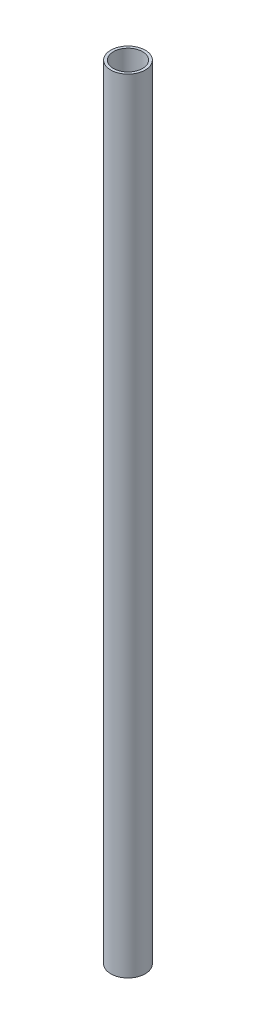
ISO-10303-21;
HEADER;
FILE_DESCRIPTION(('STEP AP214'),'2;1');
FILE_NAME('part.step','',(''),(''),'','','');
FILE_SCHEMA(('AUTOMOTIVE_DESIGN { 1 0 10303 214 1 1 1 1 }'));
ENDSEC;
DATA;
#1=APPLICATION_CONTEXT('core data for automotive mechanical design processes');
#2=APPLICATION_PROTOCOL_DEFINITION('international standard','automotive_design',2000,#1);
#3=PRODUCT_CONTEXT('',#1,'mechanical');
#4=PRODUCT('Part','Part','',(#3));
#5=PRODUCT_RELATED_PRODUCT_CATEGORY('part','',(#4));
#6=PRODUCT_DEFINITION_FORMATION('','',#4);
#7=PRODUCT_DEFINITION_CONTEXT('part definition',#1,'design');
#8=PRODUCT_DEFINITION('design','',#6,#7);
#9=PRODUCT_DEFINITION_SHAPE('','',#8);
#10=(LENGTH_UNIT() NAMED_UNIT(*) SI_UNIT(.MILLI.,.METRE.));
#11=(NAMED_UNIT(*) PLANE_ANGLE_UNIT() SI_UNIT($,.RADIAN.));
#12=(NAMED_UNIT(*) SI_UNIT($,.STERADIAN.) SOLID_ANGLE_UNIT());
#13=UNCERTAINTY_MEASURE_WITH_UNIT(LENGTH_MEASURE(1.E-05),#10,'distance_accuracy_value','');
#14=(GEOMETRIC_REPRESENTATION_CONTEXT(3) GLOBAL_UNCERTAINTY_ASSIGNED_CONTEXT((#13)) GLOBAL_UNIT_ASSIGNED_CONTEXT((#10,
#11,#12)) REPRESENTATION_CONTEXT('',''));
#15=CARTESIAN_POINT('',(0.,0.,0.));
#16=DIRECTION('',(0.,0.,1.));
#17=DIRECTION('',(1.,0.,0.));
#18=AXIS2_PLACEMENT_3D('',#15,#16,#17);
#19=CARTESIAN_POINT('',(0.,590.,0.));
#20=DIRECTION('',(0.,1.,0.));
#21=DIRECTION('',(0.,0.,1.));
#22=AXIS2_PLACEMENT_3D('',#19,#20,#21);
#23=PLANE('',#22);
#24=CARTESIAN_POINT('',(0.,590.,0.));
#25=DIRECTION('',(0.,1.,0.));
#26=DIRECTION('',(0.,0.,1.));
#27=AXIS2_PLACEMENT_3D('',#24,#25,#26);
#28=CIRCLE('',#27,13.);
#29=CARTESIAN_POINT('',(0.,590.,13.));
#30=VERTEX_POINT('',#29);
#31=EDGE_CURVE('E10',#30,#30,#28,.T.);
#32=ORIENTED_EDGE('',*,*,#31,.T.);
#33=EDGE_LOOP('',(#32));
#34=FACE_BOUND('',#33,.T.);
#35=CARTESIAN_POINT('',(0.,590.,0.));
#36=DIRECTION('',(0.,1.,0.));
#37=DIRECTION('',(0.,0.,1.));
#38=AXIS2_PLACEMENT_3D('',#35,#36,#37);
#39=CIRCLE('',#38,11.);
#40=CARTESIAN_POINT('',(0.,590.,11.));
#41=VERTEX_POINT('',#40);
#42=EDGE_CURVE('E51',#41,#41,#39,.T.);
#43=ORIENTED_EDGE('',*,*,#42,.F.);
#44=EDGE_LOOP('',(#43));
#45=FACE_BOUND('',#44,.T.);
#46=ADVANCED_FACE('F33',(#34,#45),#23,.T.);
#47=CARTESIAN_POINT('',(0.,0.,0.));
#48=DIRECTION('',(0.,1.,0.));
#49=DIRECTION('',(0.,0.,1.));
#50=AXIS2_PLACEMENT_3D('',#47,#48,#49);
#51=PLANE('',#50);
#52=CARTESIAN_POINT('',(0.,0.,0.));
#53=DIRECTION('',(0.,1.,0.));
#54=DIRECTION('',(0.,0.,1.));
#55=AXIS2_PLACEMENT_3D('',#52,#53,#54);
#56=CIRCLE('',#55,13.);
#57=CARTESIAN_POINT('',(0.,0.,13.));
#58=VERTEX_POINT('',#57);
#59=EDGE_CURVE('E46',#58,#58,#56,.T.);
#60=ORIENTED_EDGE('',*,*,#59,.F.);
#61=EDGE_LOOP('',(#60));
#62=FACE_BOUND('',#61,.T.);
#63=CARTESIAN_POINT('',(0.,0.,0.));
#64=DIRECTION('',(0.,1.,0.));
#65=DIRECTION('',(0.,0.,1.));
#66=AXIS2_PLACEMENT_3D('',#63,#64,#65);
#67=CIRCLE('',#66,11.);
#68=CARTESIAN_POINT('',(0.,0.,11.));
#69=VERTEX_POINT('',#68);
#70=EDGE_CURVE('E54',#69,#69,#67,.T.);
#71=ORIENTED_EDGE('',*,*,#70,.T.);
#72=EDGE_LOOP('',(#71));
#73=FACE_BOUND('',#72,.T.);
#74=ADVANCED_FACE('F86',(#62,#73),#51,.F.);
#75=CARTESIAN_POINT('',(0.,590.,0.));
#76=DIRECTION('',(0.,-1.,0.));
#77=DIRECTION('',(0.,0.,-1.));
#78=AXIS2_PLACEMENT_3D('',#75,#76,#77);
#79=CYLINDRICAL_SURFACE('',#78,13.);
#80=CARTESIAN_POINT('',(-13.,569.,0.));
#81=CARTESIAN_POINT('',(-12.9999974610984,569.00000524122,-0.139052660180753));
#82=CARTESIAN_POINT('',(-12.9977459806996,569.011640587298,-0.278172773072154));
#83=CARTESIAN_POINT('',(-12.9889814495606,569.057841944862,-0.552488133091363));
#84=CARTESIAN_POINT('',(-12.9824648818705,569.092426880686,-0.687680044894605));
#85=CARTESIAN_POINT('',(-12.9658986493339,569.183425580488,-0.950132537462333));
#86=CARTESIAN_POINT('',(-12.9558522492613,569.239819178274,-1.07740031971365));
#87=CARTESIAN_POINT('',(-12.9333215487839,569.372776127926,-1.3206572384235));
#88=CARTESIAN_POINT('',(-12.9208374259538,569.449338010786,-1.4366471954884));
#89=CARTESIAN_POINT('',(-12.8946323002435,569.621479165708,-1.65552432974219));
#90=CARTESIAN_POINT('',(-12.8808989548617,569.717262831451,-1.7582492953675));
#91=CARTESIAN_POINT('',(-12.8538341361734,569.924689037195,-1.94627668615612));
#92=CARTESIAN_POINT('',(-12.8405026927278,570.036332752077,-2.03157781945348));
#93=CARTESIAN_POINT('',(-12.8156309401952,570.273463995358,-2.1830167962062));
#94=CARTESIAN_POINT('',(-12.8041065326509,570.3990594311,-2.24898851450227));
#95=CARTESIAN_POINT('',(-12.7843281256073,570.659809910027,-2.35883220315189));
#96=CARTESIAN_POINT('',(-12.7760738286974,570.794964082542,-2.40270618335278));
#97=CARTESIAN_POINT('',(-12.7638947012764,571.069256191719,-2.46658610457138));
#98=CARTESIAN_POINT('',(-12.7599184822057,571.208325766697,-2.48687558791543));
#99=CARTESIAN_POINT('',(-12.7565908775945,571.48794763692,-2.50389090184761));
#100=CARTESIAN_POINT('',(-12.7572390554642,571.628499790944,-2.50061895687191));
#101=CARTESIAN_POINT('',(-12.763040258418,571.905035223162,-2.47083395608553));
#102=CARTESIAN_POINT('',(-12.7681305946622,572.041054844765,-2.44464430650053));
#103=CARTESIAN_POINT('',(-12.7821440039021,572.306732983115,-2.37027708135778));
#104=CARTESIAN_POINT('',(-12.7910672474073,572.436391216587,-2.32209852760333));
#105=CARTESIAN_POINT('',(-12.8118060352358,572.68660694382,-2.20480765459312));
#106=CARTESIAN_POINT('',(-12.8236394070727,572.807102110508,-2.13556565597226));
#107=CARTESIAN_POINT('',(-12.848853471063,573.034884971139,-1.97820505089343));
#108=CARTESIAN_POINT('',(-12.8622343280499,573.142171255592,-1.89008443268641));
#109=CARTESIAN_POINT('',(-12.889308238097,573.342358534221,-1.69572891132662));
#110=CARTESIAN_POINT('',(-12.9030027865394,573.434991190037,-1.58921761155988));
#111=CARTESIAN_POINT('',(-12.9289572102898,573.601115507301,-1.36202665615396));
#112=CARTESIAN_POINT('',(-12.9412170697587,573.674606957441,-1.24134684412446));
#113=CARTESIAN_POINT('',(-12.9629474861032,573.80040604704,-0.988957762488785));
#114=CARTESIAN_POINT('',(-12.9724142260635,573.852684734617,-0.857233713043051));
#115=CARTESIAN_POINT('',(-12.9874624721642,573.934297423347,-0.586650569197091));
#116=CARTESIAN_POINT('',(-12.993044412827,573.963633990665,-0.447792274642316));
#117=CARTESIAN_POINT('',(-12.9996341283048,573.998153766154,-0.169189915144602));
#118=CARTESIAN_POINT('',(-13.0007114935454,574.003704471841,-0.0294929779953094));
#119=CARTESIAN_POINT('',(-12.9983632998844,573.991482222803,0.248832636592824));
#120=CARTESIAN_POINT('',(-12.994937974206,573.973710476098,0.387461368986747));
#121=CARTESIAN_POINT('',(-12.9840126871957,573.915653256005,0.65854224258022));
#122=CARTESIAN_POINT('',(-12.976546573136,573.875554721574,0.791035903724994));
#123=CARTESIAN_POINT('',(-12.9583735448858,573.774185219876,1.0474195560019));
#124=CARTESIAN_POINT('',(-12.9476664018813,573.712912757703,1.1713089389197));
#125=CARTESIAN_POINT('',(-12.924025465347,573.570128256825,1.40852868267246));
#126=CARTESIAN_POINT('',(-12.9110676225358,573.488392908463,1.52172218526333));
#127=CARTESIAN_POINT('',(-12.8844225517876,573.307303776503,1.73291860543106));
#128=CARTESIAN_POINT('',(-12.8707352520445,573.207948256166,1.83092002380896));
#129=CARTESIAN_POINT('',(-12.8439416383922,572.992771838604,2.01035510164865));
#130=CARTESIAN_POINT('',(-12.8308461515727,572.876739749717,2.09153739238514));
#131=CARTESIAN_POINT('',(-12.8069410375943,572.632469675727,2.23325948833318));
#132=CARTESIAN_POINT('',(-12.7961313228739,572.504232158451,2.29380008432373));
#133=CARTESIAN_POINT('',(-12.7781075731774,572.239813641054,2.39216884187717));
#134=CARTESIAN_POINT('',(-12.770875715852,572.103675866533,2.43010977595276));
#135=CARTESIAN_POINT('',(-12.7607868732141,571.826804926794,2.48254790543445));
#136=CARTESIAN_POINT('',(-12.7579293655635,571.686072312293,2.49704789991888));
#137=CARTESIAN_POINT('',(-12.7569402050647,571.406526644079,2.50209511687348));
#138=CARTESIAN_POINT('',(-12.7587302704385,571.267720877033,2.49303910212209));
#139=CARTESIAN_POINT('',(-12.7666604796616,570.993650055494,2.45210266538044));
#140=CARTESIAN_POINT('',(-12.7728005942514,570.858384977191,2.42022239691188));
#141=CARTESIAN_POINT('',(-12.7887053259627,570.595463380158,2.33471347717501));
#142=CARTESIAN_POINT('',(-12.7984624206699,570.467791704083,2.28112994200389));
#143=CARTESIAN_POINT('',(-12.8205066533974,570.223187638109,2.15377970785526));
#144=CARTESIAN_POINT('',(-12.8327939828824,570.106256061891,2.08001148134914));
#145=CARTESIAN_POINT('',(-12.8587559030274,569.884468425315,1.91301563814422));
#146=CARTESIAN_POINT('',(-12.8724492796511,569.779831318518,1.81950009853839));
#147=CARTESIAN_POINT('',(-12.8995420316146,569.587602624506,1.61626238485003));
#148=CARTESIAN_POINT('',(-12.9129413387038,569.500014957932,1.5065364932607));
#149=CARTESIAN_POINT('',(-12.9380865705891,569.343586983144,1.27273625734659));
#150=CARTESIAN_POINT('',(-12.9498154901243,569.274933629931,1.14853493486938));
#151=CARTESIAN_POINT('',(-12.9701319076699,569.159579207636,0.890172259350404));
#152=CARTESIAN_POINT('',(-12.9787223099363,569.112857832131,0.756020253294866));
#153=CARTESIAN_POINT('',(-12.9900734375022,569.052015415785,0.51792356570557));
#154=CARTESIAN_POINT('',(-12.9937745900334,569.032543510248,0.415357439701696));
#155=CARTESIAN_POINT('',(-12.9987387895389,569.006534016363,0.208540158514695));
#156=CARTESIAN_POINT('',(-13.0000019041681,568.999996069102,0.104289050170332));
#157=CARTESIAN_POINT('',(-13.,569.,0.));
#158=B_SPLINE_CURVE_WITH_KNOTS('',3,(#80,#81,#82,#83,#84,#85,#86,#87,#88,#89,#90,#91,#92,#93,
#94,#95,#96,#97,#98,#99,#100,#101,#102,#103,#104,#105,#106,#107,#108,#109,#110,#111,#112,#113,
#114,#115,#116,#117,#118,#119,#120,#121,#122,#123,#124,#125,#126,#127,#128,#129,#130,#131,#132,
#133,#134,#135,#136,#137,#138,#139,#140,#141,#142,#143,#144,#145,#146,#147,#148,#149,#150,#151,
#152,#153,#154,#155,#156,#157),.UNSPECIFIED.,.T.,.F.,(4,2,2,2,2,2,2,2,2,2,2,2,2,2,2,2,2,2,2,2,2,
2,2,2,2,2,2,2,2,2,2,2,2,2,2,2,2,2,4),(0.,0.416776540572572,0.833897184796503,1.25063304157316,
1.66733855274583,2.0887353240409,2.51016332788516,2.93511361824239,3.3600252512715,
3.77977378984837,4.19948270045454,4.61336264699437,5.02726100716065,5.44376099870312,
5.86030539553686,6.28376393575652,6.70722715049955,7.13126639340047,7.55525819906332,
7.9726750569953,8.39007029508308,8.80402218494167,9.21800330627656,9.63671570954058,
10.0554694062924,10.4800902476651,10.9046948200738,11.3271624654496,11.7495796603135,
12.1649281712354,12.5802738884443,12.9947605928499,13.4092786732858,13.8303190431965,
14.2514561202699,14.6766136027339,15.1013766593072,15.4139664054682,15.7265474772226),.UNSPECIFIED.);
#159=CARTESIAN_POINT('',(-13.,569.,0.));
#160=VERTEX_POINT('',#159);
#161=EDGE_CURVE('E62',#160,#160,#158,.T.);
#162=ORIENTED_EDGE('',*,*,#161,.T.);
#163=EDGE_LOOP('',(#162));
#164=FACE_BOUND('',#163,.T.);
#165=CARTESIAN_POINT('',(-13.,20.,0.));
#166=CARTESIAN_POINT('',(-12.9999974610984,20.0000052412197,-0.139052660180754));
#167=CARTESIAN_POINT('',(-12.9977459806996,20.011640587298,-0.278172773072154));
#168=CARTESIAN_POINT('',(-12.9889814495606,20.0578419448622,-0.55248813309136));
#169=CARTESIAN_POINT('',(-12.9824648818705,20.092426880686,-0.687680044894599));
#170=CARTESIAN_POINT('',(-12.9658986493339,20.1834255804881,-0.950132537462371));
#171=CARTESIAN_POINT('',(-12.9558522492613,20.2398191782736,-1.07740031971373));
#172=CARTESIAN_POINT('',(-12.9333215487838,20.3727761279263,-1.32065723842358));
#173=CARTESIAN_POINT('',(-12.9208374259537,20.4493380107862,-1.43664719548844));
#174=CARTESIAN_POINT('',(-12.8946323002435,20.6214791657078,-1.65552432974222));
#175=CARTESIAN_POINT('',(-12.8808989548617,20.7172628314511,-1.75824929536754));
#176=CARTESIAN_POINT('',(-12.8538341361733,20.9246890371947,-1.94627668615616));
#177=CARTESIAN_POINT('',(-12.8405026927278,21.0363327520766,-2.03157781945352));
#178=CARTESIAN_POINT('',(-12.8156309401952,21.2734639953578,-2.18301679620621));
#179=CARTESIAN_POINT('',(-12.8041065326509,21.3990594311003,-2.24898851450225));
#180=CARTESIAN_POINT('',(-12.7843281256073,21.6598099100266,-2.35883220315187));
#181=CARTESIAN_POINT('',(-12.7760738286974,21.7949640825424,-2.40270618335278));
#182=CARTESIAN_POINT('',(-12.7638947012764,22.0692561917192,-2.46658610457138));
#183=CARTESIAN_POINT('',(-12.7599184822057,22.2083257666971,-2.48687558791542));
#184=CARTESIAN_POINT('',(-12.7565908775945,22.48794763692,-2.50389090184761));
#185=CARTESIAN_POINT('',(-12.7572390554642,22.6284997909436,-2.50061895687192));
#186=CARTESIAN_POINT('',(-12.763040258418,22.9050352231621,-2.47083395608553));
#187=CARTESIAN_POINT('',(-12.7681305946622,23.0410548447648,-2.44464430650053));
#188=CARTESIAN_POINT('',(-12.7821440039021,23.3067329831156,-2.37027708135778));
#189=CARTESIAN_POINT('',(-12.7910672474073,23.4363912165872,-2.32209852760331));
#190=CARTESIAN_POINT('',(-12.8118060352358,23.6866069438195,-2.20480765459312));
#191=CARTESIAN_POINT('',(-12.8236394070727,23.807102110508,-2.13556565597228));
#192=CARTESIAN_POINT('',(-12.848853471063,24.0348849711386,-1.97820505089347));
#193=CARTESIAN_POINT('',(-12.8622343280499,24.1421712555917,-1.89008443268647));
#194=CARTESIAN_POINT('',(-12.889308238097,24.3423585342208,-1.69572891132668));
#195=CARTESIAN_POINT('',(-12.9030027865394,24.4349911900368,-1.58921761155993));
#196=CARTESIAN_POINT('',(-12.9289572102898,24.6011155073005,-1.36202665615399));
#197=CARTESIAN_POINT('',(-12.9412170697587,24.6746069574411,-1.24134684412448));
#198=CARTESIAN_POINT('',(-12.9629474861032,24.8004060470397,-0.988957762488794));
#199=CARTESIAN_POINT('',(-12.9724142260635,24.8526847346172,-0.857233713043068));
#200=CARTESIAN_POINT('',(-12.9874624721642,24.9342974233469,-0.586650569197115));
#201=CARTESIAN_POINT('',(-12.993044412827,24.9636339906652,-0.447792274642338));
#202=CARTESIAN_POINT('',(-12.9996341283048,24.9981537661536,-0.169189915144617));
#203=CARTESIAN_POINT('',(-13.0007114935454,25.003704471841,-0.0294929779953195));
#204=CARTESIAN_POINT('',(-12.9983632998844,24.9914822228034,0.248832636592823));
#205=CARTESIAN_POINT('',(-12.994937974206,24.9737104760977,0.38746136898675));
#206=CARTESIAN_POINT('',(-12.9840126871957,24.915653256005,0.658542242580221));
#207=CARTESIAN_POINT('',(-12.976546573136,24.8755547215742,0.791035903724992));
#208=CARTESIAN_POINT('',(-12.9583735448858,24.7741852198756,1.04741955600189));
#209=CARTESIAN_POINT('',(-12.9476664018813,24.7129127577027,1.1713089389197));
#210=CARTESIAN_POINT('',(-12.924025465347,24.5701282568253,1.40852868267246));
#211=CARTESIAN_POINT('',(-12.9110676225358,24.4883929084632,1.52172218526331));
#212=CARTESIAN_POINT('',(-12.8844225517876,24.3073037765026,1.73291860543103));
#213=CARTESIAN_POINT('',(-12.8707352520445,24.207948256166,1.83092002380893));
#214=CARTESIAN_POINT('',(-12.8439416383922,23.992771838604,2.01035510164863));
#215=CARTESIAN_POINT('',(-12.8308461515727,23.876739749717,2.09153739238512));
#216=CARTESIAN_POINT('',(-12.8069410375943,23.6324696757267,2.23325948833317));
#217=CARTESIAN_POINT('',(-12.796131322874,23.5042321584514,2.29380008432373));
#218=CARTESIAN_POINT('',(-12.7781075731774,23.2398136410538,2.39216884187718));
#219=CARTESIAN_POINT('',(-12.770875715852,23.1036758665325,2.43010977595278));
#220=CARTESIAN_POINT('',(-12.7607868732141,22.8268049267935,2.48254790543446));
#221=CARTESIAN_POINT('',(-12.7579293655635,22.6860723122926,2.49704789991888));
#222=CARTESIAN_POINT('',(-12.7569402050647,22.4065266440784,2.50209511687348));
#223=CARTESIAN_POINT('',(-12.7587302704385,22.2677208770326,2.49303910212207));
#224=CARTESIAN_POINT('',(-12.7666604796616,21.9936500554936,2.45210266538041));
#225=CARTESIAN_POINT('',(-12.7728005942514,21.8583849771912,2.42022239691185));
#226=CARTESIAN_POINT('',(-12.7887053259627,21.595463380158,2.33471347717499));
#227=CARTESIAN_POINT('',(-12.7984624206699,21.4677917040824,2.28112994200388));
#228=CARTESIAN_POINT('',(-12.8205066533974,21.2231876381091,2.15377970785528));
#229=CARTESIAN_POINT('',(-12.8327939828824,21.1062560618911,2.08001148134918));
#230=CARTESIAN_POINT('',(-12.8587559030274,20.8844684253154,1.91301563814429));
#231=CARTESIAN_POINT('',(-12.8724492796511,20.7798313185179,1.81950009853845));
#232=CARTESIAN_POINT('',(-12.8995420316146,20.5876026245057,1.61626238485009));
#233=CARTESIAN_POINT('',(-12.9129413387038,20.5000149579319,1.50653649326075));
#234=CARTESIAN_POINT('',(-12.9380865705891,20.3435869831444,1.27273625734663));
#235=CARTESIAN_POINT('',(-12.9498154901243,20.2749336299309,1.14853493486942));
#236=CARTESIAN_POINT('',(-12.9701319076699,20.1595792076359,0.890172259350414));
#237=CARTESIAN_POINT('',(-12.9787223099363,20.1128578321311,0.756020253294857));
#238=CARTESIAN_POINT('',(-12.9900734375022,20.0520154157854,0.517923565705546));
#239=CARTESIAN_POINT('',(-12.9937745900334,20.0325435102477,0.415357439701677));
#240=CARTESIAN_POINT('',(-12.9987387895389,20.006534016363,0.208540158514685));
#241=CARTESIAN_POINT('',(-13.0000019041681,19.999996069102,0.104289050170327));
#242=CARTESIAN_POINT('',(-13.,20.,0.));
#243=B_SPLINE_CURVE_WITH_KNOTS('',3,(#165,#166,#167,#168,#169,#170,#171,#172,#173,#174,#175,
#176,#177,#178,#179,#180,#181,#182,#183,#184,#185,#186,#187,#188,#189,#190,#191,#192,#193,#194,
#195,#196,#197,#198,#199,#200,#201,#202,#203,#204,#205,#206,#207,#208,#209,#210,#211,#212,#213,
#214,#215,#216,#217,#218,#219,#220,#221,#222,#223,#224,#225,#226,#227,#228,#229,#230,#231,#232,
#233,#234,#235,#236,#237,#238,#239,#240,#241,#242),.UNSPECIFIED.,.T.,.F.,(4,2,2,2,2,2,2,2,2,2,2,
2,2,2,2,2,2,2,2,2,2,2,2,2,2,2,2,2,2,2,2,2,2,2,2,2,2,2,4),(0.,0.416776540572571,
0.833897184796516,1.25063304157329,1.66733855274582,2.08873532404099,2.51016332788523,
2.93511361824241,3.36002525127148,3.77977378984827,4.19948270045457,4.61336264699441,
5.02726100716069,5.44376099870307,5.86030539553681,6.28376393575654,6.70722715049957,
7.13126639340044,7.5552581990633,7.97267505699529,8.3900702950831,8.80402218494165,
9.21800330627654,9.63671570954055,10.0554694062924,10.480090247665,10.9046948200739,
11.3271624654498,11.7495796603136,12.1649281712355,12.5802738884444,12.9947605928499,
13.4092786732858,13.8303190431965,14.2514561202698,14.6766136027338,15.1013766593073,
15.4139664054683,15.7265474772226),.UNSPECIFIED.);
#244=CARTESIAN_POINT('',(-13.,20.,0.));
#245=VERTEX_POINT('',#244);
#246=EDGE_CURVE('E61',#245,#245,#243,.T.);
#247=ORIENTED_EDGE('',*,*,#246,.T.);
#248=EDGE_LOOP('',(#247));
#249=FACE_BOUND('',#248,.T.);
#250=ORIENTED_EDGE('',*,*,#31,.F.);
#251=EDGE_LOOP('',(#250));
#252=FACE_BOUND('',#251,.T.);
#253=ORIENTED_EDGE('',*,*,#59,.T.);
#254=EDGE_LOOP('',(#253));
#255=FACE_BOUND('',#254,.T.);
#256=ADVANCED_FACE('F35',(#164,#249,#252,#255),#79,.T.);
#257=CARTESIAN_POINT('',(0.,590.,0.));
#258=DIRECTION('',(0.,-1.,0.));
#259=DIRECTION('',(0.,0.,-1.));
#260=AXIS2_PLACEMENT_3D('',#257,#258,#259);
#261=CYLINDRICAL_SURFACE('',#260,11.);
#262=CARTESIAN_POINT('',(-10.7121426428143,571.5,-2.5));
#263=CARTESIAN_POINT('',(-10.7121454314233,571.638466190955,-2.49999543238962));
#264=CARTESIAN_POINT('',(-10.7148566472694,571.776986082337,-2.48845712333954));
#265=CARTESIAN_POINT('',(-10.7253866484904,572.050076575056,-2.4426652023675));
#266=CARTESIAN_POINT('',(-10.7332089369474,572.184644401534,-2.40839601066356));
#267=CARTESIAN_POINT('',(-10.7530304465066,572.445841058374,-2.31828540377217));
#268=CARTESIAN_POINT('',(-10.7650248735991,572.572478804585,-2.26246873972877));
#269=CARTESIAN_POINT('',(-10.7918333757398,572.814598399681,-2.13091974990438));
#270=CARTESIAN_POINT('',(-10.8066474399211,572.930080291558,-2.05518750087739));
#271=CARTESIAN_POINT('',(-10.8377278041731,573.148715480871,-1.88448528035882));
#272=CARTESIAN_POINT('',(-10.8540139214629,573.251635780411,-1.78922044020218));
#273=CARTESIAN_POINT('',(-10.8860302886159,573.440182505109,-1.58279346057428));
#274=CARTESIAN_POINT('',(-10.9017604930118,573.525807518394,-1.47163002451003));
#275=CARTESIAN_POINT('',(-10.93110941005,573.678263048272,-1.23499021284428));
#276=CARTESIAN_POINT('',(-10.9447020098484,573.744868200431,-1.10936512825876));
#277=CARTESIAN_POINT('',(-10.9680197641523,573.855933418413,-0.848343855636382));
#278=CARTESIAN_POINT('',(-10.9777453878714,573.90039617113,-0.712948855424489));
#279=CARTESIAN_POINT('',(-10.992093320832,573.965178095749,-0.438655593897382));
#280=CARTESIAN_POINT('',(-10.9967989680676,573.985891977357,-0.299854987503771));
#281=CARTESIAN_POINT('',(-11.0008659279287,574.003823533081,-0.0206744590409956));
#282=CARTESIAN_POINT('',(-11.0002278985982,574.001044100266,0.119705266442363));
#283=CARTESIAN_POINT('',(-10.9937426547597,573.972359271426,0.395333870912108));
#284=CARTESIAN_POINT('',(-10.9879913110538,573.946879471986,0.53062963162459));
#285=CARTESIAN_POINT('',(-10.972035500945,573.874196920349,0.794973031158423));
#286=CARTESIAN_POINT('',(-10.9618308229987,573.826993136207,0.924020372842098));
#287=CARTESIAN_POINT('',(-10.9379627182996,573.711834590133,1.17336944375689));
#288=CARTESIAN_POINT('',(-10.9242729764965,573.643721099264,1.2935952439931));
#289=CARTESIAN_POINT('',(-10.8949317146097,573.488795488044,1.52106399956617));
#290=CARTESIAN_POINT('',(-10.8792799076932,573.401980632418,1.6283050521569));
#291=CARTESIAN_POINT('',(-10.8473171066438,573.209808584337,1.82929354427357));
#292=CARTESIAN_POINT('',(-10.8309992019581,573.1040789892,1.92268414978481));
#293=CARTESIAN_POINT('',(-10.7998704044976,572.878289184263,2.09047920073135));
#294=CARTESIAN_POINT('',(-10.7850595594488,572.758228520885,2.16488304500243));
#295=CARTESIAN_POINT('',(-10.7586016791364,572.50657601189,2.29276887377834));
#296=CARTESIAN_POINT('',(-10.7469656031437,572.37494624608,2.3461786596901));
#297=CARTESIAN_POINT('',(-10.7283231226734,572.104251446261,2.43000958929393));
#298=CARTESIAN_POINT('',(-10.7213159185924,571.965187700905,2.46043470354817));
#299=CARTESIAN_POINT('',(-10.7128889420635,571.686845752338,2.49686920193376));
#300=CARTESIAN_POINT('',(-10.7113498101725,571.547639367186,2.50340025202095));
#301=CARTESIAN_POINT('',(-10.7137104989267,571.270126791855,2.49327772715817));
#302=CARTESIAN_POINT('',(-10.7176099135701,571.131820535252,2.47662588287242));
#303=CARTESIAN_POINT('',(-10.7302951733771,570.861881706192,2.42106417661718));
#304=CARTESIAN_POINT('',(-10.7390169712549,570.730185833194,2.3824458674664));
#305=CARTESIAN_POINT('',(-10.7603057031402,570.475134407569,2.28436509536447));
#306=CARTESIAN_POINT('',(-10.7728730289421,570.351779706331,2.22490050843926));
#307=CARTESIAN_POINT('',(-10.8006961734274,570.114666960961,2.08568096095001));
#308=CARTESIAN_POINT('',(-10.8159929667106,570.001101060959,2.00560710889279));
#309=CARTESIAN_POINT('',(-10.847445444588,569.788826696754,1.82785558175614));
#310=CARTESIAN_POINT('',(-10.8636012445728,569.690120235481,1.73017553739796));
#311=CARTESIAN_POINT('',(-10.8953477425749,569.508318901984,1.51761489811826));
#312=CARTESIAN_POINT('',(-10.9109203453324,569.425581075279,1.40242575322727));
#313=CARTESIAN_POINT('',(-10.9394030007809,569.280629185695,1.15948167628702));
#314=CARTESIAN_POINT('',(-10.9523131827213,569.218414126434,1.03172735466866));
#315=CARTESIAN_POINT('',(-10.9739405859898,569.11675958892,0.768105049315901));
#316=CARTESIAN_POINT('',(-10.9826854368624,569.077169672601,0.632297446270885));
#317=CARTESIAN_POINT('',(-10.9951167589318,569.021423452646,0.355736283082447));
#318=CARTESIAN_POINT('',(-10.9988040274401,569.005263455336,0.214983506118686));
#319=CARTESIAN_POINT('',(-11.0006787302882,568.997012883828,-0.0640926427285956));
#320=CARTESIAN_POINT('',(-10.9989875888252,569.004390921494,-0.202399752438774));
#321=CARTESIAN_POINT('',(-10.9905580161125,569.041810948678,-0.47574778972943));
#322=CARTESIAN_POINT('',(-10.9838196900264,569.071852465978,-0.610788785302445));
#323=CARTESIAN_POINT('',(-10.96606448264,569.153483639211,-0.873322034218794));
#324=CARTESIAN_POINT('',(-10.9550636655368,569.204992445101,-1.00084058283976));
#325=CARTESIAN_POINT('',(-10.9299536917879,569.32801922686,-1.24549315867958));
#326=CARTESIAN_POINT('',(-10.9158442081789,569.399539307688,-1.36262609174182));
#327=CARTESIAN_POINT('',(-10.8856935133435,569.562261964643,-1.58575630284185));
#328=CARTESIAN_POINT('',(-10.8696188788032,569.653834914397,-1.69147898146283));
#329=CARTESIAN_POINT('',(-10.8375213996161,569.853323970298,-1.88623829979115));
#330=CARTESIAN_POINT('',(-10.8214985685478,569.961244054585,-1.97527086605943));
#331=CARTESIAN_POINT('',(-10.7910549272231,570.192271993817,-2.13539007203787));
#332=CARTESIAN_POINT('',(-10.7766611159887,570.315579712855,-2.20619379710192));
#333=CARTESIAN_POINT('',(-10.7514502387736,570.572648851257,-2.32596037579885));
#334=CARTESIAN_POINT('',(-10.7406302556445,570.70640163398,-2.37494105401435));
#335=CARTESIAN_POINT('',(-10.72571344068,570.95016795747,-2.44129910462464));
#336=CARTESIAN_POINT('',(-10.7206593017667,571.058896172574,-2.46326828297558));
#337=CARTESIAN_POINT('',(-10.7138728814852,571.278404871809,-2.49262014337059));
#338=CARTESIAN_POINT('',(-10.712140411085,571.389185238794,-2.50000365546745));
#339=CARTESIAN_POINT('',(-10.7121426428143,571.5,-2.5));
#340=B_SPLINE_CURVE_WITH_KNOTS('',3,(#262,#263,#264,#265,#266,#267,#268,#269,#270,#271,#272,
#273,#274,#275,#276,#277,#278,#279,#280,#281,#282,#283,#284,#285,#286,#287,#288,#289,#290,#291,
#292,#293,#294,#295,#296,#297,#298,#299,#300,#301,#302,#303,#304,#305,#306,#307,#308,#309,#310,
#311,#312,#313,#314,#315,#316,#317,#318,#319,#320,#321,#322,#323,#324,#325,#326,#327,#328,#329,
#330,#331,#332,#333,#334,#335,#336,#337,#338,#339),.UNSPECIFIED.,.T.,.F.,(4,2,2,2,2,2,2,2,2,2,2,
2,2,2,2,2,2,2,2,2,2,2,2,2,2,2,2,2,2,2,2,2,2,2,2,2,2,2,4),(0.,0.414992243301661,
0.830269217244816,1.24507058357675,1.65987035130106,2.08146637272054,2.50309679657969,
2.92953338750115,3.35591821939512,3.77510878183787,4.19424772406967,4.60569006667326,
5.0171519558521,5.43181796836811,5.84654467145165,6.27057865094869,6.69462605466422,
7.12011925968862,7.54553894468127,7.96161330230361,8.37765660054304,8.78830262277895,
9.19899049685659,9.61646120958415,10.0339881436657,10.4599792598123,10.8859496910277,
11.3090538013157,11.7320912029453,12.1456463784943,12.5591929374091,12.9711958750873,
13.3832421670977,13.8036601623803,14.2241806329332,14.6508801056331,15.0772304178392,
15.4093684172413,15.7414875145232),.UNSPECIFIED.);
#341=CARTESIAN_POINT('',(-10.7121426428143,571.5,-2.5));
#342=VERTEX_POINT('',#341);
#343=EDGE_CURVE('E38',#342,#342,#340,.T.);
#344=ORIENTED_EDGE('',*,*,#343,.F.);
#345=EDGE_LOOP('',(#344));
#346=FACE_BOUND('',#345,.T.);
#347=CARTESIAN_POINT('',(-10.7121426428143,22.5,-2.5));
#348=CARTESIAN_POINT('',(-10.7121454314233,22.6384661909545,-2.49999543238962));
#349=CARTESIAN_POINT('',(-10.7148566472694,22.7769860823372,-2.48845712333954));
#350=CARTESIAN_POINT('',(-10.7253866484904,23.0500765750563,-2.44266520236751));
#351=CARTESIAN_POINT('',(-10.7332089369474,23.1846444015345,-2.40839601066357));
#352=CARTESIAN_POINT('',(-10.7530304465066,23.4458410583735,-2.31828540377217));
#353=CARTESIAN_POINT('',(-10.7650248735991,23.5724788045849,-2.26246873972878));
#354=CARTESIAN_POINT('',(-10.7918333757398,23.8145983996813,-2.13091974990438));
#355=CARTESIAN_POINT('',(-10.8066474399211,23.9300802915581,-2.05518750087741));
#356=CARTESIAN_POINT('',(-10.8377278041731,24.1487154808709,-1.88448528035886));
#357=CARTESIAN_POINT('',(-10.8540139214629,24.2516357804105,-1.78922044020224));
#358=CARTESIAN_POINT('',(-10.8860302886159,24.4401825051092,-1.58279346057436));
#359=CARTESIAN_POINT('',(-10.9017604930117,24.5258075183943,-1.4716300245101));
#360=CARTESIAN_POINT('',(-10.93110941005,24.6782630482721,-1.23499021284435));
#361=CARTESIAN_POINT('',(-10.9447020098483,24.7448682004307,-1.10936512825883));
#362=CARTESIAN_POINT('',(-10.9680197641523,24.8559334184131,-0.848343855636443));
#363=CARTESIAN_POINT('',(-10.9777453878714,24.9003961711304,-0.712948855424524));
#364=CARTESIAN_POINT('',(-10.992093320832,24.9651780957488,-0.438655593897399));
#365=CARTESIAN_POINT('',(-10.9967989680676,24.9858919773575,-0.299854987503798));
#366=CARTESIAN_POINT('',(-11.0008659279287,25.0038235330812,-0.020674459041043));
#367=CARTESIAN_POINT('',(-11.0002278985982,25.0010441002659,0.119705266442305));
#368=CARTESIAN_POINT('',(-10.9937426547597,24.9723592714265,0.395333870912043));
#369=CARTESIAN_POINT('',(-10.9879913110538,24.9468794719862,0.530629631624529));
#370=CARTESIAN_POINT('',(-10.972035500945,24.8741969203486,0.79497303115836));
#371=CARTESIAN_POINT('',(-10.9618308229987,24.8269931362066,0.924020372842029));
#372=CARTESIAN_POINT('',(-10.9379627182996,24.7118345901329,1.17336944375684));
#373=CARTESIAN_POINT('',(-10.9242729764965,24.6437210992642,1.29359524399307));
#374=CARTESIAN_POINT('',(-10.8949317146097,24.4887954880441,1.52106399956616));
#375=CARTESIAN_POINT('',(-10.8792799076932,24.401980632418,1.62830505215688));
#376=CARTESIAN_POINT('',(-10.8473171066438,24.2098085843367,1.82929354427355));
#377=CARTESIAN_POINT('',(-10.8309992019581,24.1040789891996,1.92268414978479));
#378=CARTESIAN_POINT('',(-10.7998704044976,23.8782891842626,2.09047920073133));
#379=CARTESIAN_POINT('',(-10.7850595594488,23.7582285208849,2.16488304500243));
#380=CARTESIAN_POINT('',(-10.7586016791364,23.5065760118903,2.29276887377835));
#381=CARTESIAN_POINT('',(-10.7469656031437,23.3749462460802,2.3461786596901));
#382=CARTESIAN_POINT('',(-10.7283231226734,23.1042514462607,2.43000958929392));
#383=CARTESIAN_POINT('',(-10.7213159185924,22.9651877009047,2.46043470354816));
#384=CARTESIAN_POINT('',(-10.7128889420635,22.6868457523381,2.49686920193376));
#385=CARTESIAN_POINT('',(-10.7113498101725,22.5476393671863,2.50340025202094));
#386=CARTESIAN_POINT('',(-10.7137104989267,22.2701267918547,2.49327772715816));
#387=CARTESIAN_POINT('',(-10.7176099135701,22.1318205352524,2.47662588287242));
#388=CARTESIAN_POINT('',(-10.7302951733771,21.8618817061916,2.42106417661717));
#389=CARTESIAN_POINT('',(-10.7390169712549,21.7301858331942,2.38244586746638));
#390=CARTESIAN_POINT('',(-10.7603057031402,21.4751344075693,2.28436509536444));
#391=CARTESIAN_POINT('',(-10.7728730289421,21.3517797063308,2.22490050843923));
#392=CARTESIAN_POINT('',(-10.8006961734274,21.1146669609607,2.08568096094998));
#393=CARTESIAN_POINT('',(-10.8159929667106,21.0011010609591,2.00560710889276));
#394=CARTESIAN_POINT('',(-10.847445444588,20.788826696754,1.82785558175614));
#395=CARTESIAN_POINT('',(-10.8636012445728,20.6901202354813,1.73017553739798));
#396=CARTESIAN_POINT('',(-10.8953477425749,20.5083189019842,1.51761489811829));
#397=CARTESIAN_POINT('',(-10.9109203453324,20.4255810752792,1.40242575322726));
#398=CARTESIAN_POINT('',(-10.9394030007809,20.280629185695,1.159481676287));
#399=CARTESIAN_POINT('',(-10.9523131827213,20.2184141264344,1.03172735466866));
#400=CARTESIAN_POINT('',(-10.9739405859898,20.11675958892,0.768105049315913));
#401=CARTESIAN_POINT('',(-10.9826854368624,20.0771696726011,0.632297446270903));
#402=CARTESIAN_POINT('',(-10.9951167589318,20.0214234526457,0.355736283082478));
#403=CARTESIAN_POINT('',(-10.9988040274401,20.0052634553357,0.214983506118725));
#404=CARTESIAN_POINT('',(-11.0006787302882,19.9970128838281,-0.0640926427285468));
#405=CARTESIAN_POINT('',(-10.9989875888252,20.004390921494,-0.202399752438724));
#406=CARTESIAN_POINT('',(-10.9905580161125,20.0418109486781,-0.475747789729381));
#407=CARTESIAN_POINT('',(-10.9838196900264,20.071852465978,-0.610788785302398));
#408=CARTESIAN_POINT('',(-10.96606448264,20.1534836392113,-0.873322034218738));
#409=CARTESIAN_POINT('',(-10.9550636655368,20.2049924451014,-1.00084058283969));
#410=CARTESIAN_POINT('',(-10.9299536917879,20.3280192268602,-1.24549315867952));
#411=CARTESIAN_POINT('',(-10.9158442081789,20.3995393076878,-1.36262609174177));
#412=CARTESIAN_POINT('',(-10.8856935133435,20.5622619646428,-1.58575630284182));
#413=CARTESIAN_POINT('',(-10.8696188788032,20.6538349143972,-1.69147898146279));
#414=CARTESIAN_POINT('',(-10.8375213996161,20.8533239702978,-1.88623829979112));
#415=CARTESIAN_POINT('',(-10.8214985685478,20.961244054585,-1.97527086605942));
#416=CARTESIAN_POINT('',(-10.7910549272231,21.1922719938169,-2.13539007203786));
#417=CARTESIAN_POINT('',(-10.7766611159887,21.3155797128554,-2.2061937971019));
#418=CARTESIAN_POINT('',(-10.7514502387736,21.572648851257,-2.32596037579883));
#419=CARTESIAN_POINT('',(-10.7406302556445,21.7064016339802,-2.37494105401434));
#420=CARTESIAN_POINT('',(-10.72571344068,21.95016795747,-2.44129910462464));
#421=CARTESIAN_POINT('',(-10.7206593017667,22.0588961725737,-2.46326828297558));
#422=CARTESIAN_POINT('',(-10.7138728814852,22.2784048718095,-2.49262014337059));
#423=CARTESIAN_POINT('',(-10.712140411085,22.3891852387938,-2.50000365546745));
#424=CARTESIAN_POINT('',(-10.7121426428143,22.5,-2.5));
#425=B_SPLINE_CURVE_WITH_KNOTS('',3,(#347,#348,#349,#350,#351,#352,#353,#354,#355,#356,#357,
#358,#359,#360,#361,#362,#363,#364,#365,#366,#367,#368,#369,#370,#371,#372,#373,#374,#375,#376,
#377,#378,#379,#380,#381,#382,#383,#384,#385,#386,#387,#388,#389,#390,#391,#392,#393,#394,#395,
#396,#397,#398,#399,#400,#401,#402,#403,#404,#405,#406,#407,#408,#409,#410,#411,#412,#413,#414,
#415,#416,#417,#418,#419,#420,#421,#422,#423,#424),.UNSPECIFIED.,.T.,.F.,(4,2,2,2,2,2,2,2,2,2,2,
2,2,2,2,2,2,2,2,2,2,2,2,2,2,2,2,2,2,2,2,2,2,2,2,2,2,2,4),(0.,0.41499224330163,0.830269217244779,
1.2450705835768,1.65987035130107,2.08146637272044,2.5030967965796,2.92953338750108,
3.35591821939512,3.77510878183784,4.1942477240696,4.60569006667321,5.01715195585207,
5.43181796836808,5.84654467145158,6.27057865094874,6.69462605466424,7.12011925968861,
7.54553894468119,7.96161330230364,8.37765660054311,8.78830262277903,9.19899049685668,
9.6164612095842,10.0339881436657,10.4599792598124,10.8859496910277,11.3090538013157,
11.7320912029453,12.1456463784943,12.5591929374091,12.9711958750873,13.3832421670976,
13.8036601623803,14.2241806329332,14.6508801056332,15.0772304178392,15.4093684172414,
15.7414875145232),.UNSPECIFIED.);
#426=CARTESIAN_POINT('',(-10.7121426428143,22.5,-2.5));
#427=VERTEX_POINT('',#426);
#428=EDGE_CURVE('E56',#427,#427,#425,.T.);
#429=ORIENTED_EDGE('',*,*,#428,.F.);
#430=EDGE_LOOP('',(#429));
#431=FACE_BOUND('',#430,.T.);
#432=ORIENTED_EDGE('',*,*,#42,.T.);
#433=EDGE_LOOP('',(#432));
#434=FACE_BOUND('',#433,.T.);
#435=ORIENTED_EDGE('',*,*,#70,.F.);
#436=EDGE_LOOP('',(#435));
#437=FACE_BOUND('',#436,.T.);
#438=ADVANCED_FACE('F63',(#346,#431,#434,#437),#261,.F.);
#439=CARTESIAN_POINT('',(-13.,22.5,0.));
#440=DIRECTION('',(1.,0.,0.));
#441=DIRECTION('',(0.,0.,-1.));
#442=AXIS2_PLACEMENT_3D('',#439,#440,#441);
#443=CYLINDRICAL_SURFACE('',#442,2.5);
#444=ORIENTED_EDGE('',*,*,#428,.T.);
#445=EDGE_LOOP('',(#444));
#446=FACE_BOUND('',#445,.T.);
#447=ORIENTED_EDGE('',*,*,#246,.F.);
#448=EDGE_LOOP('',(#447));
#449=FACE_BOUND('',#448,.T.);
#450=ADVANCED_FACE('F66',(#446,#449),#443,.F.);
#451=CARTESIAN_POINT('',(-13.,571.5,0.));
#452=DIRECTION('',(1.,0.,0.));
#453=DIRECTION('',(0.,0.,-1.));
#454=AXIS2_PLACEMENT_3D('',#451,#452,#453);
#455=CYLINDRICAL_SURFACE('',#454,2.5);
#456=ORIENTED_EDGE('',*,*,#343,.T.);
#457=EDGE_LOOP('',(#456));
#458=FACE_BOUND('',#457,.T.);
#459=ORIENTED_EDGE('',*,*,#161,.F.);
#460=EDGE_LOOP('',(#459));
#461=FACE_BOUND('',#460,.T.);
#462=ADVANCED_FACE('F69',(#458,#461),#455,.F.);
#463=CLOSED_SHELL('',(#46,#74,#256,#438,#450,#462));
#464=MANIFOLD_SOLID_BREP('B2',#463);
#465=ADVANCED_BREP_SHAPE_REPRESENTATION('',(#18,#464),#14);
#466=SHAPE_DEFINITION_REPRESENTATION(#9,#465);
ENDSEC;
END-ISO-10303-21;
